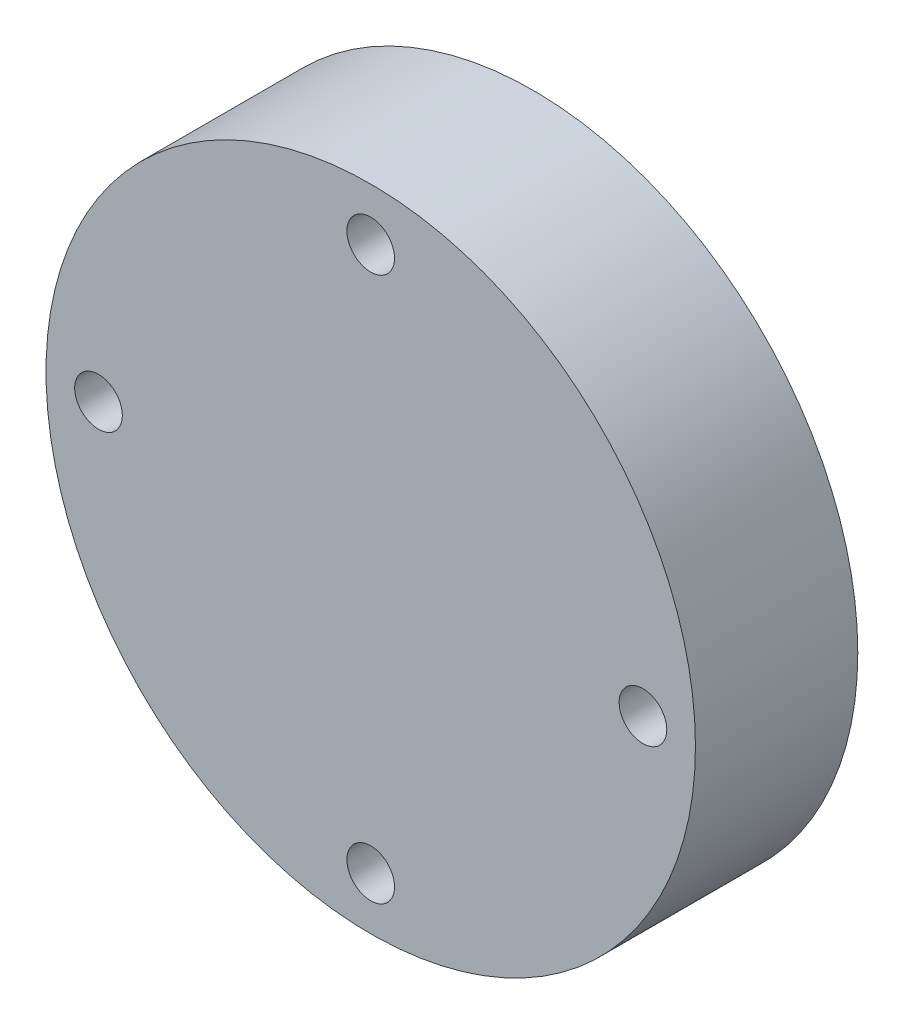
ISO-10303-21;
HEADER;
FILE_DESCRIPTION(('STEP AP214'),'2;1');
FILE_NAME('part.step','',(''),(''),'','','');
FILE_SCHEMA(('AUTOMOTIVE_DESIGN { 1 0 10303 214 1 1 1 1 }'));
ENDSEC;
DATA;
#1=APPLICATION_CONTEXT('core data for automotive mechanical design processes');
#2=APPLICATION_PROTOCOL_DEFINITION('international standard','automotive_design',2000,#1);
#3=PRODUCT_CONTEXT('',#1,'mechanical');
#4=PRODUCT('Part','Part','',(#3));
#5=PRODUCT_RELATED_PRODUCT_CATEGORY('part','',(#4));
#6=PRODUCT_DEFINITION_FORMATION('','',#4);
#7=PRODUCT_DEFINITION_CONTEXT('part definition',#1,'design');
#8=PRODUCT_DEFINITION('design','',#6,#7);
#9=PRODUCT_DEFINITION_SHAPE('','',#8);
#10=(LENGTH_UNIT() NAMED_UNIT(*) SI_UNIT(.MILLI.,.METRE.));
#11=(NAMED_UNIT(*) PLANE_ANGLE_UNIT() SI_UNIT($,.RADIAN.));
#12=(NAMED_UNIT(*) SI_UNIT($,.STERADIAN.) SOLID_ANGLE_UNIT());
#13=UNCERTAINTY_MEASURE_WITH_UNIT(LENGTH_MEASURE(1.E-05),#10,'distance_accuracy_value','');
#14=(GEOMETRIC_REPRESENTATION_CONTEXT(3) GLOBAL_UNCERTAINTY_ASSIGNED_CONTEXT((#13)) GLOBAL_UNIT_ASSIGNED_CONTEXT((#10,
#11,#12)) REPRESENTATION_CONTEXT('',''));
#15=CARTESIAN_POINT('',(0.,0.,0.));
#16=DIRECTION('',(0.,0.,1.));
#17=DIRECTION('',(1.,0.,0.));
#18=AXIS2_PLACEMENT_3D('',#15,#16,#17);
#19=CARTESIAN_POINT('',(0.,0.,15.));
#20=DIRECTION('',(0.,0.,-1.));
#21=DIRECTION('',(-1.,0.,0.));
#22=AXIS2_PLACEMENT_3D('',#19,#20,#21);
#23=CYLINDRICAL_SURFACE('',#22,30.);
#24=CARTESIAN_POINT('',(0.,0.,15.));
#25=DIRECTION('',(0.,0.,1.));
#26=DIRECTION('',(1.,0.,0.));
#27=AXIS2_PLACEMENT_3D('',#24,#25,#26);
#28=CIRCLE('',#27,30.);
#29=CARTESIAN_POINT('',(30.,0.,15.));
#30=VERTEX_POINT('',#29);
#31=EDGE_CURVE('E10',#30,#30,#28,.T.);
#32=ORIENTED_EDGE('',*,*,#31,.F.);
#33=EDGE_LOOP('',(#32));
#34=FACE_BOUND('',#33,.T.);
#35=CARTESIAN_POINT('',(0.,0.,0.));
#36=DIRECTION('',(0.,0.,1.));
#37=DIRECTION('',(1.,0.,0.));
#38=AXIS2_PLACEMENT_3D('',#35,#36,#37);
#39=CIRCLE('',#38,30.);
#40=CARTESIAN_POINT('',(30.,0.,0.));
#41=VERTEX_POINT('',#40);
#42=EDGE_CURVE('E39',#41,#41,#39,.T.);
#43=ORIENTED_EDGE('',*,*,#42,.T.);
#44=EDGE_LOOP('',(#43));
#45=FACE_BOUND('',#44,.T.);
#46=ADVANCED_FACE('F32',(#34,#45),#23,.T.);
#47=CARTESIAN_POINT('',(0.,0.,15.));
#48=DIRECTION('',(0.,0.,1.));
#49=DIRECTION('',(1.,0.,0.));
#50=AXIS2_PLACEMENT_3D('',#47,#48,#49);
#51=PLANE('',#50);
#52=CARTESIAN_POINT('',(0.,25.15,15.));
#53=DIRECTION('',(0.,0.,1.));
#54=DIRECTION('',(1.,0.,0.));
#55=AXIS2_PLACEMENT_3D('',#52,#53,#54);
#56=CIRCLE('',#55,2.2);
#57=CARTESIAN_POINT('',(2.2,25.15,15.));
#58=VERTEX_POINT('',#57);
#59=EDGE_CURVE('E44',#58,#58,#56,.T.);
#60=ORIENTED_EDGE('',*,*,#59,.F.);
#61=EDGE_LOOP('',(#60));
#62=FACE_BOUND('',#61,.T.);
#63=CARTESIAN_POINT('',(25.1500000000007,7.11726005474805E-13,15.));
#64=DIRECTION('',(0.,0.,1.));
#65=DIRECTION('',(1.,0.,0.));
#66=AXIS2_PLACEMENT_3D('',#63,#64,#65);
#67=CIRCLE('',#66,2.20000000000056);
#68=CARTESIAN_POINT('',(27.3500000000013,7.11726005474805E-13,15.));
#69=VERTEX_POINT('',#68);
#70=EDGE_CURVE('E68',#69,#69,#67,.T.);
#71=ORIENTED_EDGE('',*,*,#70,.F.);
#72=EDGE_LOOP('',(#71));
#73=FACE_BOUND('',#72,.T.);
#74=CARTESIAN_POINT('',(1.42345201094961E-12,-25.15,15.));
#75=DIRECTION('',(0.,0.,1.));
#76=DIRECTION('',(1.,0.,0.));
#77=AXIS2_PLACEMENT_3D('',#74,#75,#76);
#78=CIRCLE('',#77,2.20000000000153);
#79=CARTESIAN_POINT('',(2.20000000000295,-25.15,15.));
#80=VERTEX_POINT('',#79);
#81=EDGE_CURVE('E64',#80,#80,#78,.T.);
#82=ORIENTED_EDGE('',*,*,#81,.F.);
#83=EDGE_LOOP('',(#82));
#84=FACE_BOUND('',#83,.T.);
#85=CARTESIAN_POINT('',(-25.1499999999993,-7.14805992174661E-13,15.));
#86=DIRECTION('',(0.,0.,1.));
#87=DIRECTION('',(1.,0.,0.));
#88=AXIS2_PLACEMENT_3D('',#85,#86,#87);
#89=CIRCLE('',#88,2.20000000000114);
#90=CARTESIAN_POINT('',(-22.9499999999981,-7.14805992174661E-13,15.));
#91=VERTEX_POINT('',#90);
#92=EDGE_CURVE('E47',#91,#91,#89,.T.);
#93=ORIENTED_EDGE('',*,*,#92,.F.);
#94=EDGE_LOOP('',(#93));
#95=FACE_BOUND('',#94,.T.);
#96=ORIENTED_EDGE('',*,*,#31,.T.);
#97=EDGE_LOOP('',(#96));
#98=FACE_BOUND('',#97,.T.);
#99=ADVANCED_FACE('F124',(#62,#73,#84,#95,#98),#51,.T.);
#100=CARTESIAN_POINT('',(0.,0.,0.));
#101=DIRECTION('',(0.,0.,1.));
#102=DIRECTION('',(1.,0.,0.));
#103=AXIS2_PLACEMENT_3D('',#100,#101,#102);
#104=PLANE('',#103);
#105=CARTESIAN_POINT('',(0.,0.,0.));
#106=DIRECTION('',(0.,0.,1.));
#107=DIRECTION('',(1.,0.,0.));
#108=AXIS2_PLACEMENT_3D('',#105,#106,#107);
#109=CIRCLE('',#108,8.);
#110=CARTESIAN_POINT('',(8.,0.,0.));
#111=VERTEX_POINT('',#110);
#112=EDGE_CURVE('E100',#111,#111,#109,.T.);
#113=ORIENTED_EDGE('',*,*,#112,.T.);
#114=EDGE_LOOP('',(#113));
#115=FACE_BOUND('',#114,.T.);
#116=CARTESIAN_POINT('',(0.,25.15,0.));
#117=DIRECTION('',(0.,0.,1.));
#118=DIRECTION('',(1.,0.,0.));
#119=AXIS2_PLACEMENT_3D('',#116,#117,#118);
#120=CIRCLE('',#119,4.);
#121=CARTESIAN_POINT('',(4.,25.15,0.));
#122=VERTEX_POINT('',#121);
#123=EDGE_CURVE('E95',#122,#122,#120,.T.);
#124=ORIENTED_EDGE('',*,*,#123,.T.);
#125=EDGE_LOOP('',(#124));
#126=FACE_BOUND('',#125,.T.);
#127=CARTESIAN_POINT('',(25.1500000000007,7.11726005474805E-13,0.));
#128=DIRECTION('',(0.,0.,1.));
#129=DIRECTION('',(1.,0.,0.));
#130=AXIS2_PLACEMENT_3D('',#127,#128,#129);
#131=CIRCLE('',#130,4.00000000000056);
#132=CARTESIAN_POINT('',(29.1500000000013,7.11726005474805E-13,0.));
#133=VERTEX_POINT('',#132);
#134=EDGE_CURVE('E89',#133,#133,#131,.T.);
#135=ORIENTED_EDGE('',*,*,#134,.T.);
#136=EDGE_LOOP('',(#135));
#137=FACE_BOUND('',#136,.T.);
#138=CARTESIAN_POINT('',(1.42345201094961E-12,-25.15,0.));
#139=DIRECTION('',(0.,0.,1.));
#140=DIRECTION('',(1.,0.,0.));
#141=AXIS2_PLACEMENT_3D('',#138,#139,#140);
#142=CIRCLE('',#141,4.00000000000153);
#143=CARTESIAN_POINT('',(4.00000000000295,-25.15,0.));
#144=VERTEX_POINT('',#143);
#145=EDGE_CURVE('E83',#144,#144,#142,.T.);
#146=ORIENTED_EDGE('',*,*,#145,.T.);
#147=EDGE_LOOP('',(#146));
#148=FACE_BOUND('',#147,.T.);
#149=CARTESIAN_POINT('',(-25.1499999999993,-7.14805992174661E-13,0.));
#150=DIRECTION('',(0.,0.,1.));
#151=DIRECTION('',(1.,0.,0.));
#152=AXIS2_PLACEMENT_3D('',#149,#150,#151);
#153=CIRCLE('',#152,4.00000000000114);
#154=CARTESIAN_POINT('',(-21.1499999999981,-7.14805992174661E-13,0.));
#155=VERTEX_POINT('',#154);
#156=EDGE_CURVE('E76',#155,#155,#153,.T.);
#157=ORIENTED_EDGE('',*,*,#156,.T.);
#158=EDGE_LOOP('',(#157));
#159=FACE_BOUND('',#158,.T.);
#160=ORIENTED_EDGE('',*,*,#42,.F.);
#161=EDGE_LOOP('',(#160));
#162=FACE_BOUND('',#161,.T.);
#163=ADVANCED_FACE('F129',(#115,#126,#137,#148,#159,#162),#104,.F.);
#164=CARTESIAN_POINT('',(-25.1499999999993,-7.14805992174661E-13,21.2225396744459));
#165=DIRECTION('',(0.,0.,-1.));
#166=DIRECTION('',(-1.,0.,0.));
#167=AXIS2_PLACEMENT_3D('',#164,#165,#166);
#168=CYLINDRICAL_SURFACE('',#167,2.20000000000114);
#169=CARTESIAN_POINT('',(-25.1499999999993,-7.14805992174661E-13,4.5));
#170=DIRECTION('',(0.,0.,1.));
#171=DIRECTION('',(1.,0.,0.));
#172=AXIS2_PLACEMENT_3D('',#169,#170,#171);
#173=CIRCLE('',#172,2.20000000000114);
#174=CARTESIAN_POINT('',(-22.9499999999981,-7.14805992174661E-13,4.5));
#175=VERTEX_POINT('',#174);
#176=EDGE_CURVE('E35',#175,#175,#173,.T.);
#177=ORIENTED_EDGE('',*,*,#176,.F.);
#178=EDGE_LOOP('',(#177));
#179=FACE_BOUND('',#178,.T.);
#180=ORIENTED_EDGE('',*,*,#92,.T.);
#181=EDGE_LOOP('',(#180));
#182=FACE_BOUND('',#181,.T.);
#183=ADVANCED_FACE('F136',(#179,#182),#168,.F.);
#184=CARTESIAN_POINT('',(1.42345201094961E-12,-25.15,21.2225396744459));
#185=DIRECTION('',(0.,0.,-1.));
#186=DIRECTION('',(-1.,0.,0.));
#187=AXIS2_PLACEMENT_3D('',#184,#185,#186);
#188=CYLINDRICAL_SURFACE('',#187,2.20000000000153);
#189=CARTESIAN_POINT('',(1.42345201094961E-12,-25.15,4.5));
#190=DIRECTION('',(0.,0.,1.));
#191=DIRECTION('',(1.,0.,0.));
#192=AXIS2_PLACEMENT_3D('',#189,#190,#191);
#193=CIRCLE('',#192,2.20000000000153);
#194=CARTESIAN_POINT('',(2.20000000000295,-25.15,4.5));
#195=VERTEX_POINT('',#194);
#196=EDGE_CURVE('E56',#195,#195,#193,.T.);
#197=ORIENTED_EDGE('',*,*,#196,.F.);
#198=EDGE_LOOP('',(#197));
#199=FACE_BOUND('',#198,.T.);
#200=ORIENTED_EDGE('',*,*,#81,.T.);
#201=EDGE_LOOP('',(#200));
#202=FACE_BOUND('',#201,.T.);
#203=ADVANCED_FACE('F141',(#199,#202),#188,.F.);
#204=CARTESIAN_POINT('',(25.1500000000007,7.11726005474805E-13,21.2225396744459));
#205=DIRECTION('',(0.,0.,-1.));
#206=DIRECTION('',(-1.,0.,0.));
#207=AXIS2_PLACEMENT_3D('',#204,#205,#206);
#208=CYLINDRICAL_SURFACE('',#207,2.20000000000056);
#209=CARTESIAN_POINT('',(25.1500000000007,7.11726005474805E-13,4.5));
#210=DIRECTION('',(0.,0.,1.));
#211=DIRECTION('',(1.,0.,0.));
#212=AXIS2_PLACEMENT_3D('',#209,#210,#211);
#213=CIRCLE('',#212,2.20000000000056);
#214=CARTESIAN_POINT('',(27.3500000000013,7.11726005474805E-13,4.5));
#215=VERTEX_POINT('',#214);
#216=EDGE_CURVE('E53',#215,#215,#213,.T.);
#217=ORIENTED_EDGE('',*,*,#216,.F.);
#218=EDGE_LOOP('',(#217));
#219=FACE_BOUND('',#218,.T.);
#220=ORIENTED_EDGE('',*,*,#70,.T.);
#221=EDGE_LOOP('',(#220));
#222=FACE_BOUND('',#221,.T.);
#223=ADVANCED_FACE('F148',(#219,#222),#208,.F.);
#224=CARTESIAN_POINT('',(0.,25.15,21.2225396744459));
#225=DIRECTION('',(0.,0.,-1.));
#226=DIRECTION('',(-1.,0.,0.));
#227=AXIS2_PLACEMENT_3D('',#224,#225,#226);
#228=CYLINDRICAL_SURFACE('',#227,2.2);
#229=CARTESIAN_POINT('',(0.,25.15,4.5));
#230=DIRECTION('',(0.,0.,1.));
#231=DIRECTION('',(1.,0.,0.));
#232=AXIS2_PLACEMENT_3D('',#229,#230,#231);
#233=CIRCLE('',#232,2.2);
#234=CARTESIAN_POINT('',(2.2,25.15,4.5));
#235=VERTEX_POINT('',#234);
#236=EDGE_CURVE('E50',#235,#235,#233,.T.);
#237=ORIENTED_EDGE('',*,*,#236,.F.);
#238=EDGE_LOOP('',(#237));
#239=FACE_BOUND('',#238,.T.);
#240=ORIENTED_EDGE('',*,*,#59,.T.);
#241=EDGE_LOOP('',(#240));
#242=FACE_BOUND('',#241,.T.);
#243=ADVANCED_FACE('F152',(#239,#242),#228,.F.);
#244=CARTESIAN_POINT('',(0.,25.15,4.5));
#245=DIRECTION('',(0.,0.,-1.));
#246=DIRECTION('',(-1.,0.,0.));
#247=AXIS2_PLACEMENT_3D('',#244,#245,#246);
#248=CYLINDRICAL_SURFACE('',#247,4.);
#249=CARTESIAN_POINT('',(0.,25.15,4.5));
#250=DIRECTION('',(0.,0.,1.));
#251=DIRECTION('',(1.,0.,0.));
#252=AXIS2_PLACEMENT_3D('',#249,#250,#251);
#253=CIRCLE('',#252,4.);
#254=CARTESIAN_POINT('',(4.,25.15,4.5));
#255=VERTEX_POINT('',#254);
#256=EDGE_CURVE('E54',#255,#255,#253,.T.);
#257=ORIENTED_EDGE('',*,*,#256,.T.);
#258=EDGE_LOOP('',(#257));
#259=FACE_BOUND('',#258,.T.);
#260=ORIENTED_EDGE('',*,*,#123,.F.);
#261=EDGE_LOOP('',(#260));
#262=FACE_BOUND('',#261,.T.);
#263=ADVANCED_FACE('F156',(#259,#262),#248,.F.);
#264=CARTESIAN_POINT('',(0.,25.15,4.5));
#265=DIRECTION('',(0.,0.,1.));
#266=DIRECTION('',(1.,0.,0.));
#267=AXIS2_PLACEMENT_3D('',#264,#265,#266);
#268=PLANE('',#267);
#269=ORIENTED_EDGE('',*,*,#236,.T.);
#270=EDGE_LOOP('',(#269));
#271=FACE_BOUND('',#270,.T.);
#272=ORIENTED_EDGE('',*,*,#256,.F.);
#273=EDGE_LOOP('',(#272));
#274=FACE_BOUND('',#273,.T.);
#275=ADVANCED_FACE('F177',(#271,#274),#268,.F.);
#276=CARTESIAN_POINT('',(25.1500000000007,7.11726005474805E-13,4.5));
#277=DIRECTION('',(0.,0.,-1.));
#278=DIRECTION('',(-1.,0.,0.));
#279=AXIS2_PLACEMENT_3D('',#276,#277,#278);
#280=CYLINDRICAL_SURFACE('',#279,4.00000000000056);
#281=CARTESIAN_POINT('',(25.1500000000007,7.11726005474805E-13,4.5));
#282=DIRECTION('',(0.,0.,1.));
#283=DIRECTION('',(1.,0.,0.));
#284=AXIS2_PLACEMENT_3D('',#281,#282,#283);
#285=CIRCLE('',#284,4.00000000000056);
#286=CARTESIAN_POINT('',(29.1500000000013,7.11726005474805E-13,4.5));
#287=VERTEX_POINT('',#286);
#288=EDGE_CURVE('E92',#287,#287,#285,.T.);
#289=ORIENTED_EDGE('',*,*,#288,.T.);
#290=EDGE_LOOP('',(#289));
#291=FACE_BOUND('',#290,.T.);
#292=ORIENTED_EDGE('',*,*,#134,.F.);
#293=EDGE_LOOP('',(#292));
#294=FACE_BOUND('',#293,.T.);
#295=ADVANCED_FACE('F174',(#291,#294),#280,.F.);
#296=CARTESIAN_POINT('',(25.1500000000007,7.11726005474805E-13,4.5));
#297=DIRECTION('',(0.,0.,1.));
#298=DIRECTION('',(1.,0.,0.));
#299=AXIS2_PLACEMENT_3D('',#296,#297,#298);
#300=PLANE('',#299);
#301=ORIENTED_EDGE('',*,*,#216,.T.);
#302=EDGE_LOOP('',(#301));
#303=FACE_BOUND('',#302,.T.);
#304=ORIENTED_EDGE('',*,*,#288,.F.);
#305=EDGE_LOOP('',(#304));
#306=FACE_BOUND('',#305,.T.);
#307=ADVANCED_FACE('F170',(#303,#306),#300,.F.);
#308=CARTESIAN_POINT('',(1.42345201094961E-12,-25.15,4.5));
#309=DIRECTION('',(0.,0.,-1.));
#310=DIRECTION('',(-1.,0.,0.));
#311=AXIS2_PLACEMENT_3D('',#308,#309,#310);
#312=CYLINDRICAL_SURFACE('',#311,4.00000000000153);
#313=CARTESIAN_POINT('',(1.42345201094961E-12,-25.15,4.5));
#314=DIRECTION('',(0.,0.,1.));
#315=DIRECTION('',(1.,0.,0.));
#316=AXIS2_PLACEMENT_3D('',#313,#314,#315);
#317=CIRCLE('',#316,4.00000000000153);
#318=CARTESIAN_POINT('',(4.00000000000295,-25.15,4.5));
#319=VERTEX_POINT('',#318);
#320=EDGE_CURVE('E86',#319,#319,#317,.T.);
#321=ORIENTED_EDGE('',*,*,#320,.T.);
#322=EDGE_LOOP('',(#321));
#323=FACE_BOUND('',#322,.T.);
#324=ORIENTED_EDGE('',*,*,#145,.F.);
#325=EDGE_LOOP('',(#324));
#326=FACE_BOUND('',#325,.T.);
#327=ADVANCED_FACE('F167',(#323,#326),#312,.F.);
#328=CARTESIAN_POINT('',(1.42345201094961E-12,-25.15,4.5));
#329=DIRECTION('',(0.,0.,1.));
#330=DIRECTION('',(1.,0.,0.));
#331=AXIS2_PLACEMENT_3D('',#328,#329,#330);
#332=PLANE('',#331);
#333=ORIENTED_EDGE('',*,*,#196,.T.);
#334=EDGE_LOOP('',(#333));
#335=FACE_BOUND('',#334,.T.);
#336=ORIENTED_EDGE('',*,*,#320,.F.);
#337=EDGE_LOOP('',(#336));
#338=FACE_BOUND('',#337,.T.);
#339=ADVANCED_FACE('F162',(#335,#338),#332,.F.);
#340=CARTESIAN_POINT('',(-25.1499999999993,-7.14805992174661E-13,4.5));
#341=DIRECTION('',(0.,0.,-1.));
#342=DIRECTION('',(-1.,0.,0.));
#343=AXIS2_PLACEMENT_3D('',#340,#341,#342);
#344=CYLINDRICAL_SURFACE('',#343,4.00000000000114);
#345=CARTESIAN_POINT('',(-25.1499999999993,-7.14805992174661E-13,4.5));
#346=DIRECTION('',(0.,0.,1.));
#347=DIRECTION('',(1.,0.,0.));
#348=AXIS2_PLACEMENT_3D('',#345,#346,#347);
#349=CIRCLE('',#348,4.00000000000114);
#350=CARTESIAN_POINT('',(-21.1499999999981,-7.14805992174661E-13,4.5));
#351=VERTEX_POINT('',#350);
#352=EDGE_CURVE('E79',#351,#351,#349,.T.);
#353=ORIENTED_EDGE('',*,*,#352,.T.);
#354=EDGE_LOOP('',(#353));
#355=FACE_BOUND('',#354,.T.);
#356=ORIENTED_EDGE('',*,*,#156,.F.);
#357=EDGE_LOOP('',(#356));
#358=FACE_BOUND('',#357,.T.);
#359=ADVANCED_FACE('F158',(#355,#358),#344,.F.);
#360=CARTESIAN_POINT('',(-25.1499999999993,-7.14805992174661E-13,4.5));
#361=DIRECTION('',(0.,0.,1.));
#362=DIRECTION('',(1.,0.,0.));
#363=AXIS2_PLACEMENT_3D('',#360,#361,#362);
#364=PLANE('',#363);
#365=ORIENTED_EDGE('',*,*,#176,.T.);
#366=EDGE_LOOP('',(#365));
#367=FACE_BOUND('',#366,.T.);
#368=ORIENTED_EDGE('',*,*,#352,.F.);
#369=EDGE_LOOP('',(#368));
#370=FACE_BOUND('',#369,.T.);
#371=ADVANCED_FACE('F161',(#367,#370),#364,.F.);
#372=CARTESIAN_POINT('',(0.,0.,-1.5));
#373=DIRECTION('',(0.,0.,1.));
#374=DIRECTION('',(1.,0.,0.));
#375=AXIS2_PLACEMENT_3D('',#372,#373,#374);
#376=CYLINDRICAL_SURFACE('',#375,8.);
#377=CARTESIAN_POINT('',(0.,0.,-1.5));
#378=DIRECTION('',(0.,0.,1.));
#379=DIRECTION('',(1.,0.,0.));
#380=AXIS2_PLACEMENT_3D('',#377,#378,#379);
#381=CIRCLE('',#380,8.);
#382=CARTESIAN_POINT('',(8.,0.,-1.5));
#383=VERTEX_POINT('',#382);
#384=EDGE_CURVE('E80',#383,#383,#381,.T.);
#385=ORIENTED_EDGE('',*,*,#384,.T.);
#386=EDGE_LOOP('',(#385));
#387=FACE_BOUND('',#386,.T.);
#388=ORIENTED_EDGE('',*,*,#112,.F.);
#389=EDGE_LOOP('',(#388));
#390=FACE_BOUND('',#389,.T.);
#391=ADVANCED_FACE('F166',(#387,#390),#376,.T.);
#392=CARTESIAN_POINT('',(0.,0.,-1.5));
#393=DIRECTION('',(0.,0.,1.));
#394=DIRECTION('',(1.,0.,0.));
#395=AXIS2_PLACEMENT_3D('',#392,#393,#394);
#396=PLANE('',#395);
#397=CARTESIAN_POINT('',(0.,0.,-1.5));
#398=DIRECTION('',(0.,0.,1.));
#399=DIRECTION('',(1.,0.,0.));
#400=AXIS2_PLACEMENT_3D('',#397,#398,#399);
#401=CIRCLE('',#400,3.25);
#402=CARTESIAN_POINT('',(3.25,0.,-1.5));
#403=VERTEX_POINT('',#402);
#404=EDGE_CURVE('E106',#403,#403,#401,.T.);
#405=ORIENTED_EDGE('',*,*,#404,.T.);
#406=EDGE_LOOP('',(#405));
#407=FACE_BOUND('',#406,.T.);
#408=ORIENTED_EDGE('',*,*,#384,.F.);
#409=EDGE_LOOP('',(#408));
#410=FACE_BOUND('',#409,.T.);
#411=ADVANCED_FACE('F121',(#407,#410),#396,.F.);
#412=CARTESIAN_POINT('',(0.,0.,5.5));
#413=DIRECTION('',(0.,0.,-1.));
#414=DIRECTION('',(-1.,0.,0.));
#415=AXIS2_PLACEMENT_3D('',#412,#413,#414);
#416=CYLINDRICAL_SURFACE('',#415,3.25);
#417=CARTESIAN_POINT('',(0.,0.,5.5));
#418=DIRECTION('',(0.,0.,1.));
#419=DIRECTION('',(1.,0.,0.));
#420=AXIS2_PLACEMENT_3D('',#417,#418,#419);
#421=CIRCLE('',#420,3.25);
#422=CARTESIAN_POINT('',(3.25,0.,5.5));
#423=VERTEX_POINT('',#422);
#424=EDGE_CURVE('E103',#423,#423,#421,.T.);
#425=ORIENTED_EDGE('',*,*,#424,.T.);
#426=EDGE_LOOP('',(#425));
#427=FACE_BOUND('',#426,.T.);
#428=ORIENTED_EDGE('',*,*,#404,.F.);
#429=EDGE_LOOP('',(#428));
#430=FACE_BOUND('',#429,.T.);
#431=ADVANCED_FACE('F112',(#427,#430),#416,.F.);
#432=CARTESIAN_POINT('',(0.,0.,5.5));
#433=DIRECTION('',(0.,0.,1.));
#434=DIRECTION('',(1.,0.,0.));
#435=AXIS2_PLACEMENT_3D('',#432,#433,#434);
#436=PLANE('',#435);
#437=ORIENTED_EDGE('',*,*,#424,.F.);
#438=EDGE_LOOP('',(#437));
#439=FACE_BOUND('',#438,.T.);
#440=ADVANCED_FACE('F115',(#439),#436,.F.);
#441=CLOSED_SHELL('',(#46,#99,#163,#183,#203,#223,#243,#263,#275,#295,#307,#327,#339,#359,#371,
#391,#411,#431,#440));
#442=MANIFOLD_SOLID_BREP('B2',#441);
#443=ADVANCED_BREP_SHAPE_REPRESENTATION('',(#18,#442),#14);
#444=SHAPE_DEFINITION_REPRESENTATION(#9,#443);
ENDSEC;
END-ISO-10303-21;
